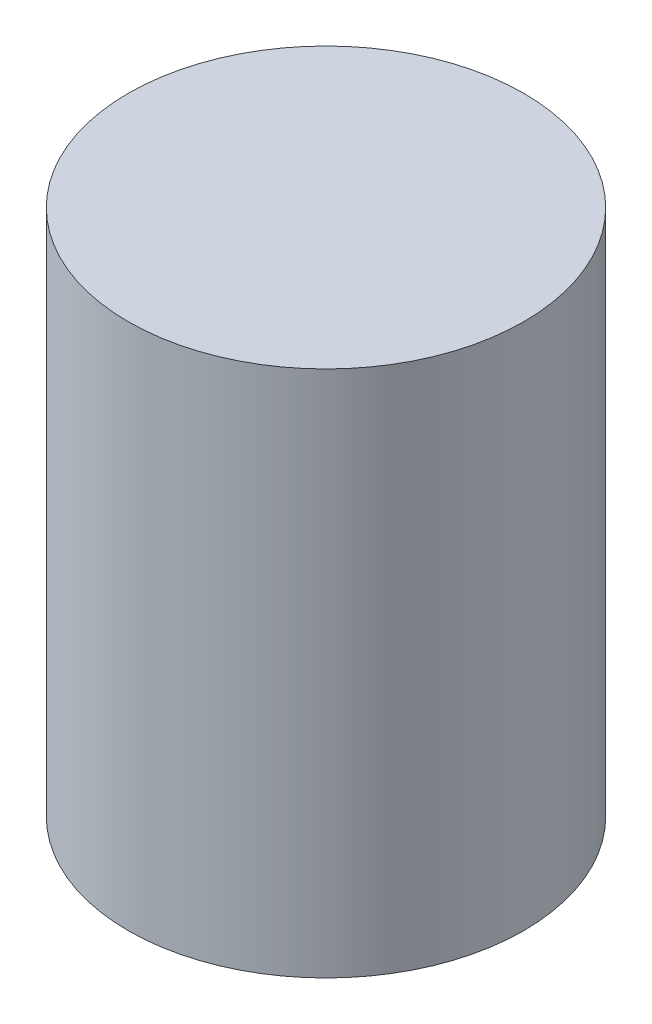
ISO-10303-21;
HEADER;
FILE_DESCRIPTION(('STEP AP214'),'2;1');
FILE_NAME('part.step','',(''),(''),'','','');
FILE_SCHEMA(('AUTOMOTIVE_DESIGN { 1 0 10303 214 1 1 1 1 }'));
ENDSEC;
DATA;
#1=APPLICATION_CONTEXT('core data for automotive mechanical design processes');
#2=APPLICATION_PROTOCOL_DEFINITION('international standard','automotive_design',2000,#1);
#3=PRODUCT_CONTEXT('',#1,'mechanical');
#4=PRODUCT('Part','Part','',(#3));
#5=PRODUCT_RELATED_PRODUCT_CATEGORY('part','',(#4));
#6=PRODUCT_DEFINITION_FORMATION('','',#4);
#7=PRODUCT_DEFINITION_CONTEXT('part definition',#1,'design');
#8=PRODUCT_DEFINITION('design','',#6,#7);
#9=PRODUCT_DEFINITION_SHAPE('','',#8);
#10=(LENGTH_UNIT() NAMED_UNIT(*) SI_UNIT(.MILLI.,.METRE.));
#11=(NAMED_UNIT(*) PLANE_ANGLE_UNIT() SI_UNIT($,.RADIAN.));
#12=(NAMED_UNIT(*) SI_UNIT($,.STERADIAN.) SOLID_ANGLE_UNIT());
#13=UNCERTAINTY_MEASURE_WITH_UNIT(LENGTH_MEASURE(1.E-05),#10,'distance_accuracy_value','');
#14=(GEOMETRIC_REPRESENTATION_CONTEXT(3) GLOBAL_UNCERTAINTY_ASSIGNED_CONTEXT((#13)) GLOBAL_UNIT_ASSIGNED_CONTEXT((#10,
#11,#12)) REPRESENTATION_CONTEXT('',''));
#15=CARTESIAN_POINT('',(0.,0.,0.));
#16=DIRECTION('',(0.,0.,1.));
#17=DIRECTION('',(1.,0.,0.));
#18=AXIS2_PLACEMENT_3D('',#15,#16,#17);
#19=CARTESIAN_POINT('',(0.,4.,0.));
#20=DIRECTION('',(0.,-1.,0.));
#21=DIRECTION('',(0.,0.,-1.));
#22=AXIS2_PLACEMENT_3D('',#19,#20,#21);
#23=CYLINDRICAL_SURFACE('',#22,1.5);
#24=CARTESIAN_POINT('',(0.,4.,0.));
#25=DIRECTION('',(0.,1.,0.));
#26=DIRECTION('',(0.,0.,1.));
#27=AXIS2_PLACEMENT_3D('',#24,#25,#26);
#28=CIRCLE('',#27,1.5);
#29=CARTESIAN_POINT('',(0.,4.,1.5));
#30=VERTEX_POINT('',#29);
#31=EDGE_CURVE('E10',#30,#30,#28,.T.);
#32=ORIENTED_EDGE('',*,*,#31,.F.);
#33=EDGE_LOOP('',(#32));
#34=FACE_BOUND('',#33,.T.);
#35=CARTESIAN_POINT('',(0.,0.,0.));
#36=DIRECTION('',(0.,1.,0.));
#37=DIRECTION('',(0.,0.,1.));
#38=AXIS2_PLACEMENT_3D('',#35,#36,#37);
#39=CIRCLE('',#38,1.5);
#40=CARTESIAN_POINT('',(0.,0.,1.5));
#41=VERTEX_POINT('',#40);
#42=EDGE_CURVE('E42',#41,#41,#39,.T.);
#43=ORIENTED_EDGE('',*,*,#42,.T.);
#44=EDGE_LOOP('',(#43));
#45=FACE_BOUND('',#44,.T.);
#46=ADVANCED_FACE('F39',(#34,#45),#23,.T.);
#47=CARTESIAN_POINT('',(0.,4.,0.));
#48=DIRECTION('',(0.,1.,0.));
#49=DIRECTION('',(0.,0.,1.));
#50=AXIS2_PLACEMENT_3D('',#47,#48,#49);
#51=PLANE('',#50);
#52=ORIENTED_EDGE('',*,*,#31,.T.);
#53=EDGE_LOOP('',(#52));
#54=FACE_BOUND('',#53,.T.);
#55=ADVANCED_FACE('F56',(#54),#51,.T.);
#56=CARTESIAN_POINT('',(0.,0.,0.));
#57=DIRECTION('',(0.,1.,0.));
#58=DIRECTION('',(0.,0.,1.));
#59=AXIS2_PLACEMENT_3D('',#56,#57,#58);
#60=PLANE('',#59);
#61=ORIENTED_EDGE('',*,*,#42,.F.);
#62=EDGE_LOOP('',(#61));
#63=FACE_BOUND('',#62,.T.);
#64=ADVANCED_FACE('F54',(#63),#60,.F.);
#65=CLOSED_SHELL('',(#46,#55,#64));
#66=MANIFOLD_SOLID_BREP('B2',#65);
#67=ADVANCED_BREP_SHAPE_REPRESENTATION('',(#18,#66),#14);
#68=SHAPE_DEFINITION_REPRESENTATION(#9,#67);
ENDSEC;
END-ISO-10303-21;
